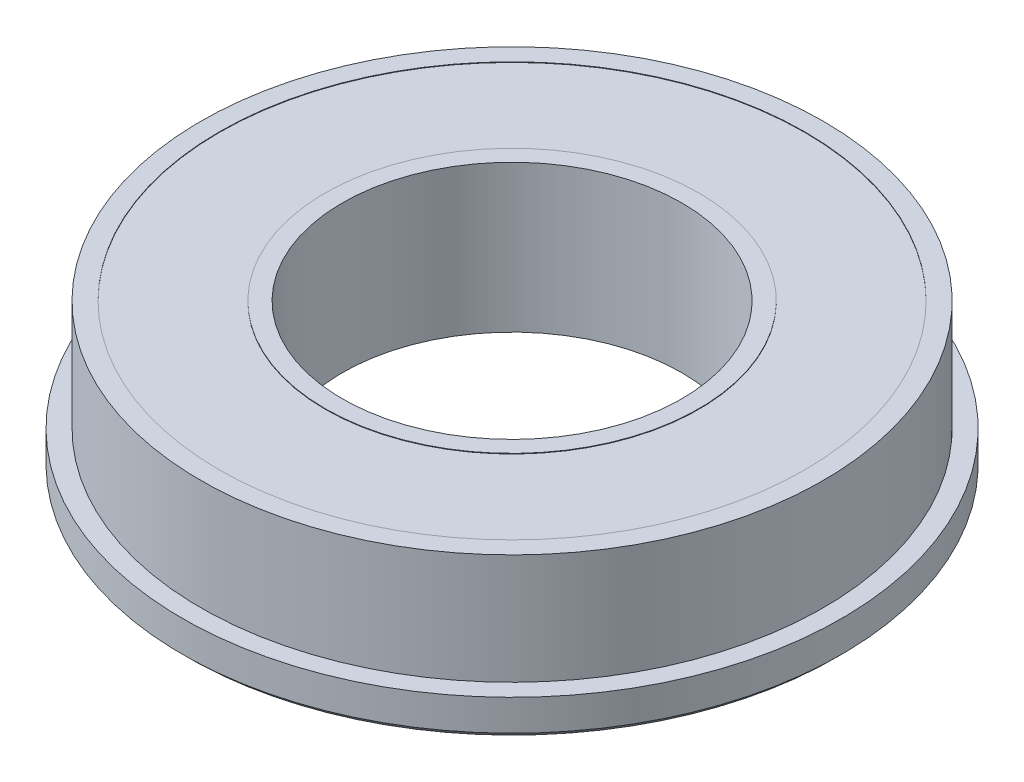
ISO-10303-21;
HEADER;
FILE_DESCRIPTION(('STEP AP214'),'2;1');
FILE_NAME('part.step','',(''),(''),'','','');
FILE_SCHEMA(('AUTOMOTIVE_DESIGN { 1 0 10303 214 1 1 1 1 }'));
ENDSEC;
DATA;
#1=APPLICATION_CONTEXT('core data for automotive mechanical design processes');
#2=APPLICATION_PROTOCOL_DEFINITION('international standard','automotive_design',2000,#1);
#3=PRODUCT_CONTEXT('',#1,'mechanical');
#4=PRODUCT('Part','Part','',(#3));
#5=PRODUCT_RELATED_PRODUCT_CATEGORY('part','',(#4));
#6=PRODUCT_DEFINITION_FORMATION('','',#4);
#7=PRODUCT_DEFINITION_CONTEXT('part definition',#1,'design');
#8=PRODUCT_DEFINITION('design','',#6,#7);
#9=PRODUCT_DEFINITION_SHAPE('','',#8);
#10=(LENGTH_UNIT() NAMED_UNIT(*) SI_UNIT(.MILLI.,.METRE.));
#11=(NAMED_UNIT(*) PLANE_ANGLE_UNIT() SI_UNIT($,.RADIAN.));
#12=(NAMED_UNIT(*) SI_UNIT($,.STERADIAN.) SOLID_ANGLE_UNIT());
#13=UNCERTAINTY_MEASURE_WITH_UNIT(LENGTH_MEASURE(1.E-05),#10,'distance_accuracy_value','');
#14=(GEOMETRIC_REPRESENTATION_CONTEXT(3) GLOBAL_UNCERTAINTY_ASSIGNED_CONTEXT((#13)) GLOBAL_UNIT_ASSIGNED_CONTEXT((#10,
#11,#12)) REPRESENTATION_CONTEXT('',''));
#15=CARTESIAN_POINT('',(0.,0.,0.));
#16=DIRECTION('',(0.,0.,1.));
#17=DIRECTION('',(1.,0.,0.));
#18=AXIS2_PLACEMENT_3D('',#15,#16,#17);
#19=CARTESIAN_POINT('',(0.,0.,0.));
#20=DIRECTION('',(0.,-1.,0.));
#21=DIRECTION('',(0.,0.,-1.));
#22=AXIS2_PLACEMENT_3D('',#19,#20,#21);
#23=CYLINDRICAL_SURFACE('',#22,15.);
#24=CARTESIAN_POINT('',(0.,0.,0.));
#25=DIRECTION('',(0.,-1.,0.));
#26=DIRECTION('',(0.,0.,-1.));
#27=AXIS2_PLACEMENT_3D('',#24,#25,#26);
#28=CIRCLE('',#27,15.);
#29=CARTESIAN_POINT('',(0.,0.,-15.));
#30=VERTEX_POINT('',#29);
#31=EDGE_CURVE('E63',#30,#30,#28,.T.);
#32=ORIENTED_EDGE('',*,*,#31,.T.);
#33=EDGE_LOOP('',(#32));
#34=FACE_BOUND('',#33,.T.);
#35=CARTESIAN_POINT('',(0.,13.,0.));
#36=DIRECTION('',(0.,-1.,0.));
#37=DIRECTION('',(0.,0.,-1.));
#38=AXIS2_PLACEMENT_3D('',#35,#36,#37);
#39=CIRCLE('',#38,15.);
#40=CARTESIAN_POINT('',(0.,13.,-15.));
#41=VERTEX_POINT('',#40);
#42=EDGE_CURVE('E112',#41,#41,#39,.T.);
#43=ORIENTED_EDGE('',*,*,#42,.F.);
#44=EDGE_LOOP('',(#43));
#45=FACE_BOUND('',#44,.T.);
#46=ADVANCED_FACE('F47',(#34,#45),#23,.F.);
#47=CARTESIAN_POINT('',(15.,0.,0.));
#48=DIRECTION('',(0.,-1.,0.));
#49=DIRECTION('',(0.,0.,-1.));
#50=AXIS2_PLACEMENT_3D('',#47,#48,#49);
#51=PLANE('',#50);
#52=CARTESIAN_POINT('',(0.,0.,0.));
#53=DIRECTION('',(0.,-1.,0.));
#54=DIRECTION('',(0.,0.,-1.));
#55=AXIS2_PLACEMENT_3D('',#52,#53,#54);
#56=CIRCLE('',#55,16.5127062063416);
#57=CARTESIAN_POINT('',(0.,0.,-16.5127062063416));
#58=VERTEX_POINT('',#57);
#59=EDGE_CURVE('E69',#58,#58,#56,.T.);
#60=ORIENTED_EDGE('',*,*,#59,.T.);
#61=EDGE_LOOP('',(#60));
#62=FACE_BOUND('',#61,.T.);
#63=ORIENTED_EDGE('',*,*,#31,.F.);
#64=EDGE_LOOP('',(#63));
#65=FACE_BOUND('',#64,.T.);
#66=ADVANCED_FACE('F123',(#62,#65),#51,.T.);
#67=CARTESIAN_POINT('',(0.,0.,0.));
#68=DIRECTION('',(0.,-1.,0.));
#69=DIRECTION('',(0.,0.,-1.));
#70=AXIS2_PLACEMENT_3D('',#67,#68,#69);
#71=CYLINDRICAL_SURFACE('',#70,16.5127062063416);
#72=CARTESIAN_POINT('',(0.,0.0484380633045418,0.));
#73=DIRECTION('',(0.,-1.,0.));
#74=DIRECTION('',(0.,0.,-1.));
#75=AXIS2_PLACEMENT_3D('',#72,#73,#74);
#76=CIRCLE('',#75,16.5127062063416);
#77=CARTESIAN_POINT('',(0.,0.0484380633045418,-16.5127062063416));
#78=VERTEX_POINT('',#77);
#79=EDGE_CURVE('E75',#78,#78,#76,.T.);
#80=ORIENTED_EDGE('',*,*,#79,.T.);
#81=EDGE_LOOP('',(#80));
#82=FACE_BOUND('',#81,.T.);
#83=ORIENTED_EDGE('',*,*,#59,.F.);
#84=EDGE_LOOP('',(#83));
#85=FACE_BOUND('',#84,.T.);
#86=ADVANCED_FACE('F129',(#82,#85),#71,.T.);
#87=CARTESIAN_POINT('',(16.5127062063416,0.0484380633045418,0.));
#88=DIRECTION('',(0.,-1.,0.));
#89=DIRECTION('',(0.,0.,-1.));
#90=AXIS2_PLACEMENT_3D('',#87,#88,#89);
#91=PLANE('',#90);
#92=CARTESIAN_POINT('',(0.,0.0484380633045418,0.));
#93=DIRECTION('',(0.,-1.,0.));
#94=DIRECTION('',(0.,0.,-1.));
#95=AXIS2_PLACEMENT_3D('',#92,#93,#94);
#96=CIRCLE('',#95,25.8733875125464);
#97=CARTESIAN_POINT('',(0.,0.0484380633045418,-25.8733875125464));
#98=VERTEX_POINT('',#97);
#99=EDGE_CURVE('E78',#98,#98,#96,.T.);
#100=ORIENTED_EDGE('',*,*,#99,.T.);
#101=EDGE_LOOP('',(#100));
#102=FACE_BOUND('',#101,.T.);
#103=ORIENTED_EDGE('',*,*,#79,.F.);
#104=EDGE_LOOP('',(#103));
#105=FACE_BOUND('',#104,.T.);
#106=ADVANCED_FACE('F135',(#102,#105),#91,.T.);
#107=CARTESIAN_POINT('',(0.,0.,0.));
#108=DIRECTION('',(0.,-1.,0.));
#109=DIRECTION('',(0.,0.,-1.));
#110=AXIS2_PLACEMENT_3D('',#107,#108,#109);
#111=CYLINDRICAL_SURFACE('',#110,25.8733875125464);
#112=CARTESIAN_POINT('',(0.,0.,0.));
#113=DIRECTION('',(0.,-1.,0.));
#114=DIRECTION('',(0.,0.,-1.));
#115=AXIS2_PLACEMENT_3D('',#112,#113,#114);
#116=CIRCLE('',#115,25.8733875125464);
#117=CARTESIAN_POINT('',(0.,0.,-25.8733875125464));
#118=VERTEX_POINT('',#117);
#119=EDGE_CURVE('E81',#118,#118,#116,.T.);
#120=ORIENTED_EDGE('',*,*,#119,.T.);
#121=EDGE_LOOP('',(#120));
#122=FACE_BOUND('',#121,.T.);
#123=ORIENTED_EDGE('',*,*,#99,.F.);
#124=EDGE_LOOP('',(#123));
#125=FACE_BOUND('',#124,.T.);
#126=ADVANCED_FACE('F139',(#122,#125),#111,.F.);
#127=CARTESIAN_POINT('',(25.8733875125464,0.,0.));
#128=DIRECTION('',(0.,-1.,0.));
#129=DIRECTION('',(0.,0.,-1.));
#130=AXIS2_PLACEMENT_3D('',#127,#128,#129);
#131=PLANE('',#130);
#132=CARTESIAN_POINT('',(0.,0.,0.));
#133=DIRECTION('',(0.,-1.,0.));
#134=DIRECTION('',(0.,0.,-1.));
#135=AXIS2_PLACEMENT_3D('',#132,#133,#134);
#136=CIRCLE('',#135,28.625);
#137=CARTESIAN_POINT('',(0.,0.,-28.625));
#138=VERTEX_POINT('',#137);
#139=EDGE_CURVE('E56',#138,#138,#136,.T.);
#140=ORIENTED_EDGE('',*,*,#139,.T.);
#141=EDGE_LOOP('',(#140));
#142=FACE_BOUND('',#141,.T.);
#143=ORIENTED_EDGE('',*,*,#119,.F.);
#144=EDGE_LOOP('',(#143));
#145=FACE_BOUND('',#144,.T.);
#146=ADVANCED_FACE('F143',(#142,#145),#131,.T.);
#147=CARTESIAN_POINT('',(0.,0.,0.));
#148=DIRECTION('',(0.,-1.,0.));
#149=DIRECTION('',(0.,0.,-1.));
#150=AXIS2_PLACEMENT_3D('',#147,#148,#149);
#151=CYLINDRICAL_SURFACE('',#150,29.125);
#152=CARTESIAN_POINT('',(0.,0.500000000000007,0.));
#153=DIRECTION('',(0.,-1.,0.));
#154=DIRECTION('',(0.,0.,-1.));
#155=AXIS2_PLACEMENT_3D('',#152,#153,#154);
#156=CIRCLE('',#155,29.125);
#157=CARTESIAN_POINT('',(0.,0.500000000000007,-29.125));
#158=VERTEX_POINT('',#157);
#159=EDGE_CURVE('E10',#158,#158,#156,.F.);
#160=ORIENTED_EDGE('',*,*,#159,.T.);
#161=EDGE_LOOP('',(#160));
#162=FACE_BOUND('',#161,.T.);
#163=CARTESIAN_POINT('',(0.,3.25,0.));
#164=DIRECTION('',(0.,-1.,0.));
#165=DIRECTION('',(0.,0.,-1.));
#166=AXIS2_PLACEMENT_3D('',#163,#164,#165);
#167=CIRCLE('',#166,29.125);
#168=CARTESIAN_POINT('',(0.,3.25,-29.125));
#169=VERTEX_POINT('',#168);
#170=EDGE_CURVE('E84',#169,#169,#167,.T.);
#171=ORIENTED_EDGE('',*,*,#170,.T.);
#172=EDGE_LOOP('',(#171));
#173=FACE_BOUND('',#172,.T.);
#174=ADVANCED_FACE('F147',(#162,#173),#151,.T.);
#175=CARTESIAN_POINT('',(29.125,3.25,0.));
#176=DIRECTION('',(0.,1.,0.));
#177=DIRECTION('',(0.,0.,1.));
#178=AXIS2_PLACEMENT_3D('',#175,#176,#177);
#179=PLANE('',#178);
#180=CARTESIAN_POINT('',(0.,3.25,0.));
#181=DIRECTION('',(0.,-1.,0.));
#182=DIRECTION('',(0.,0.,-1.));
#183=AXIS2_PLACEMENT_3D('',#180,#181,#182);
#184=CIRCLE('',#183,27.5);
#185=CARTESIAN_POINT('',(0.,3.25,-27.5));
#186=VERTEX_POINT('',#185);
#187=EDGE_CURVE('E88',#186,#186,#184,.T.);
#188=ORIENTED_EDGE('',*,*,#187,.T.);
#189=EDGE_LOOP('',(#188));
#190=FACE_BOUND('',#189,.T.);
#191=ORIENTED_EDGE('',*,*,#170,.F.);
#192=EDGE_LOOP('',(#191));
#193=FACE_BOUND('',#192,.T.);
#194=ADVANCED_FACE('F150',(#190,#193),#179,.T.);
#195=CARTESIAN_POINT('',(0.,0.,0.));
#196=DIRECTION('',(0.,-1.,0.));
#197=DIRECTION('',(0.,0.,-1.));
#198=AXIS2_PLACEMENT_3D('',#195,#196,#197);
#199=CYLINDRICAL_SURFACE('',#198,27.5);
#200=CARTESIAN_POINT('',(0.,13.,0.));
#201=DIRECTION('',(0.,-1.,0.));
#202=DIRECTION('',(0.,0.,-1.));
#203=AXIS2_PLACEMENT_3D('',#200,#201,#202);
#204=CIRCLE('',#203,27.5);
#205=CARTESIAN_POINT('',(0.,13.,-27.5));
#206=VERTEX_POINT('',#205);
#207=EDGE_CURVE('E92',#206,#206,#204,.T.);
#208=ORIENTED_EDGE('',*,*,#207,.T.);
#209=EDGE_LOOP('',(#208));
#210=FACE_BOUND('',#209,.T.);
#211=ORIENTED_EDGE('',*,*,#187,.F.);
#212=EDGE_LOOP('',(#211));
#213=FACE_BOUND('',#212,.T.);
#214=ADVANCED_FACE('F153',(#210,#213),#199,.T.);
#215=CARTESIAN_POINT('',(27.5,13.,0.));
#216=DIRECTION('',(0.,1.,0.));
#217=DIRECTION('',(0.,0.,1.));
#218=AXIS2_PLACEMENT_3D('',#215,#216,#217);
#219=PLANE('',#218);
#220=CARTESIAN_POINT('',(0.,13.,0.));
#221=DIRECTION('',(0.,-1.,0.));
#222=DIRECTION('',(0.,0.,-1.));
#223=AXIS2_PLACEMENT_3D('',#220,#221,#222);
#224=CIRCLE('',#223,25.8733875125464);
#225=CARTESIAN_POINT('',(0.,13.,-25.8733875125464));
#226=VERTEX_POINT('',#225);
#227=EDGE_CURVE('E96',#226,#226,#224,.T.);
#228=ORIENTED_EDGE('',*,*,#227,.T.);
#229=EDGE_LOOP('',(#228));
#230=FACE_BOUND('',#229,.T.);
#231=ORIENTED_EDGE('',*,*,#207,.F.);
#232=EDGE_LOOP('',(#231));
#233=FACE_BOUND('',#232,.T.);
#234=ADVANCED_FACE('F156',(#230,#233),#219,.T.);
#235=CARTESIAN_POINT('',(0.,0.,0.));
#236=DIRECTION('',(0.,-1.,0.));
#237=DIRECTION('',(0.,0.,-1.));
#238=AXIS2_PLACEMENT_3D('',#235,#236,#237);
#239=CYLINDRICAL_SURFACE('',#238,25.8733875125464);
#240=CARTESIAN_POINT('',(0.,12.9515619366955,0.));
#241=DIRECTION('',(0.,-1.,0.));
#242=DIRECTION('',(0.,0.,-1.));
#243=AXIS2_PLACEMENT_3D('',#240,#241,#242);
#244=CIRCLE('',#243,25.8733875125464);
#245=CARTESIAN_POINT('',(0.,12.9515619366955,-25.8733875125464));
#246=VERTEX_POINT('',#245);
#247=EDGE_CURVE('E100',#246,#246,#244,.T.);
#248=ORIENTED_EDGE('',*,*,#247,.T.);
#249=EDGE_LOOP('',(#248));
#250=FACE_BOUND('',#249,.T.);
#251=ORIENTED_EDGE('',*,*,#227,.F.);
#252=EDGE_LOOP('',(#251));
#253=FACE_BOUND('',#252,.T.);
#254=ADVANCED_FACE('F160',(#250,#253),#239,.F.);
#255=CARTESIAN_POINT('',(16.5127062063416,12.9515619366955,0.));
#256=DIRECTION('',(0.,1.,0.));
#257=DIRECTION('',(0.,0.,1.));
#258=AXIS2_PLACEMENT_3D('',#255,#256,#257);
#259=PLANE('',#258);
#260=CARTESIAN_POINT('',(0.,12.9515619366955,0.));
#261=DIRECTION('',(0.,-1.,0.));
#262=DIRECTION('',(0.,0.,-1.));
#263=AXIS2_PLACEMENT_3D('',#260,#261,#262);
#264=CIRCLE('',#263,16.5127062063416);
#265=CARTESIAN_POINT('',(0.,12.9515619366955,-16.5127062063416));
#266=VERTEX_POINT('',#265);
#267=EDGE_CURVE('E104',#266,#266,#264,.T.);
#268=ORIENTED_EDGE('',*,*,#267,.T.);
#269=EDGE_LOOP('',(#268));
#270=FACE_BOUND('',#269,.T.);
#271=ORIENTED_EDGE('',*,*,#247,.F.);
#272=EDGE_LOOP('',(#271));
#273=FACE_BOUND('',#272,.T.);
#274=ADVANCED_FACE('F164',(#270,#273),#259,.T.);
#275=CARTESIAN_POINT('',(0.,0.,0.));
#276=DIRECTION('',(0.,-1.,0.));
#277=DIRECTION('',(0.,0.,-1.));
#278=AXIS2_PLACEMENT_3D('',#275,#276,#277);
#279=CYLINDRICAL_SURFACE('',#278,16.5127062063416);
#280=CARTESIAN_POINT('',(0.,13.,0.));
#281=DIRECTION('',(0.,-1.,0.));
#282=DIRECTION('',(0.,0.,-1.));
#283=AXIS2_PLACEMENT_3D('',#280,#281,#282);
#284=CIRCLE('',#283,16.5127062063416);
#285=CARTESIAN_POINT('',(0.,13.,-16.5127062063416));
#286=VERTEX_POINT('',#285);
#287=EDGE_CURVE('E108',#286,#286,#284,.T.);
#288=ORIENTED_EDGE('',*,*,#287,.T.);
#289=EDGE_LOOP('',(#288));
#290=FACE_BOUND('',#289,.T.);
#291=ORIENTED_EDGE('',*,*,#267,.F.);
#292=EDGE_LOOP('',(#291));
#293=FACE_BOUND('',#292,.T.);
#294=ADVANCED_FACE('F168',(#290,#293),#279,.T.);
#295=CARTESIAN_POINT('',(16.5127062063416,13.,0.));
#296=DIRECTION('',(0.,1.,0.));
#297=DIRECTION('',(0.,0.,1.));
#298=AXIS2_PLACEMENT_3D('',#295,#296,#297);
#299=PLANE('',#298);
#300=ORIENTED_EDGE('',*,*,#42,.T.);
#301=EDGE_LOOP('',(#300));
#302=FACE_BOUND('',#301,.T.);
#303=ORIENTED_EDGE('',*,*,#287,.F.);
#304=EDGE_LOOP('',(#303));
#305=FACE_BOUND('',#304,.T.);
#306=ADVANCED_FACE('F119',(#302,#305),#299,.T.);
#307=CARTESIAN_POINT('',(0.,0.,0.));
#308=DIRECTION('',(0.,1.,0.));
#309=DIRECTION('',(0.,0.,1.));
#310=AXIS2_PLACEMENT_3D('',#307,#308,#309);
#311=CONICAL_SURFACE('',#310,28.625,0.785398163397438);
#312=ORIENTED_EDGE('',*,*,#159,.F.);
#313=EDGE_LOOP('',(#312));
#314=FACE_BOUND('',#313,.T.);
#315=ORIENTED_EDGE('',*,*,#139,.F.);
#316=EDGE_LOOP('',(#315));
#317=FACE_BOUND('',#316,.T.);
#318=ADVANCED_FACE('F50',(#314,#317),#311,.T.);
#319=CLOSED_SHELL('',(#46,#66,#86,#106,#126,#146,#174,#194,#214,#234,#254,#274,#294,#306,#318));
#320=MANIFOLD_SOLID_BREP('B2',#319);
#321=ADVANCED_BREP_SHAPE_REPRESENTATION('',(#18,#320),#14);
#322=SHAPE_DEFINITION_REPRESENTATION(#9,#321);
ENDSEC;
END-ISO-10303-21;
